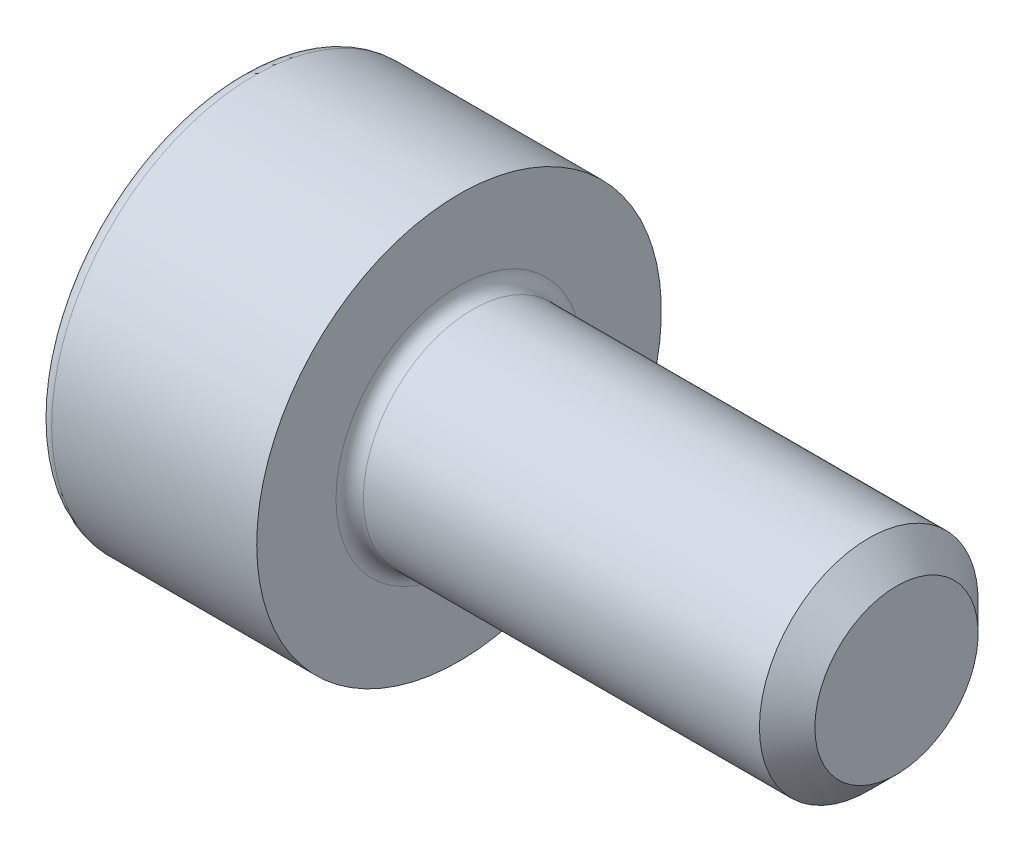
ISO-10303-21;
HEADER;
FILE_DESCRIPTION(('STEP AP214'),'2;1');
FILE_NAME('part.step','',(''),(''),'','','');
FILE_SCHEMA(('AUTOMOTIVE_DESIGN { 1 0 10303 214 1 1 1 1 }'));
ENDSEC;
DATA;
#1=APPLICATION_CONTEXT('core data for automotive mechanical design processes');
#2=APPLICATION_PROTOCOL_DEFINITION('international standard','automotive_design',2000,#1);
#3=PRODUCT_CONTEXT('',#1,'mechanical');
#4=PRODUCT('Part','Part','',(#3));
#5=PRODUCT_RELATED_PRODUCT_CATEGORY('part','',(#4));
#6=PRODUCT_DEFINITION_FORMATION('','',#4);
#7=PRODUCT_DEFINITION_CONTEXT('part definition',#1,'design');
#8=PRODUCT_DEFINITION('design','',#6,#7);
#9=PRODUCT_DEFINITION_SHAPE('','',#8);
#10=(LENGTH_UNIT() NAMED_UNIT(*) SI_UNIT(.MILLI.,.METRE.));
#11=(NAMED_UNIT(*) PLANE_ANGLE_UNIT() SI_UNIT($,.RADIAN.));
#12=(NAMED_UNIT(*) SI_UNIT($,.STERADIAN.) SOLID_ANGLE_UNIT());
#13=UNCERTAINTY_MEASURE_WITH_UNIT(LENGTH_MEASURE(1.E-05),#10,'distance_accuracy_value','');
#14=(GEOMETRIC_REPRESENTATION_CONTEXT(3) GLOBAL_UNCERTAINTY_ASSIGNED_CONTEXT((#13)) GLOBAL_UNIT_ASSIGNED_CONTEXT((#10,
#11,#12)) REPRESENTATION_CONTEXT('',''));
#15=CARTESIAN_POINT('',(0.,0.,0.));
#16=DIRECTION('',(0.,0.,1.));
#17=DIRECTION('',(1.,0.,0.));
#18=AXIS2_PLACEMENT_3D('',#15,#16,#17);
#19=CARTESIAN_POINT('',(4.,0.,0.));
#20=DIRECTION('',(-1.,0.,0.));
#21=DIRECTION('',(0.,0.,1.));
#22=AXIS2_PLACEMENT_3D('',#19,#20,#21);
#23=CONICAL_SURFACE('',#22,0.746499999993503,0.785398163397449);
#24=CARTESIAN_POINT('',(3.7464999999935,0.,0.));
#25=DIRECTION('',(-1.,0.,0.));
#26=DIRECTION('',(0.,0.,1.));
#27=AXIS2_PLACEMENT_3D('',#24,#25,#26);
#28=CIRCLE('',#27,1.);
#29=CARTESIAN_POINT('',(3.7464999999935,0.,1.));
#30=VERTEX_POINT('',#29);
#31=EDGE_CURVE('E11',#30,#30,#28,.T.);
#32=ORIENTED_EDGE('',*,*,#31,.F.);
#33=EDGE_LOOP('',(#32));
#34=FACE_BOUND('',#33,.T.);
#35=CARTESIAN_POINT('',(4.,0.,0.));
#36=DIRECTION('',(-1.,0.,0.));
#37=DIRECTION('',(0.,0.,1.));
#38=AXIS2_PLACEMENT_3D('',#35,#36,#37);
#39=CIRCLE('',#38,0.746499999993503);
#40=CARTESIAN_POINT('',(4.,0.,0.746499999993503));
#41=VERTEX_POINT('',#40);
#42=EDGE_CURVE('E134',#41,#41,#39,.T.);
#43=ORIENTED_EDGE('',*,*,#42,.T.);
#44=EDGE_LOOP('',(#43));
#45=FACE_BOUND('',#44,.T.);
#46=ADVANCED_FACE('F33',(#34,#45),#23,.T.);
#47=CARTESIAN_POINT('',(-2.,0.,0.));
#48=DIRECTION('',(-1.,0.,0.));
#49=DIRECTION('',(0.,0.,1.));
#50=AXIS2_PLACEMENT_3D('',#47,#48,#49);
#51=CYLINDRICAL_SURFACE('',#50,1.);
#52=CARTESIAN_POINT('',(0.125,0.,0.));
#53=DIRECTION('',(-1.,0.,0.));
#54=DIRECTION('',(0.,0.,1.));
#55=AXIS2_PLACEMENT_3D('',#52,#53,#54);
#56=CIRCLE('',#55,1.);
#57=CARTESIAN_POINT('',(0.125,0.,1.));
#58=VERTEX_POINT('',#57);
#59=EDGE_CURVE('E40',#58,#58,#56,.T.);
#60=ORIENTED_EDGE('',*,*,#59,.F.);
#61=EDGE_LOOP('',(#60));
#62=FACE_BOUND('',#61,.T.);
#63=ORIENTED_EDGE('',*,*,#31,.T.);
#64=EDGE_LOOP('',(#63));
#65=FACE_BOUND('',#64,.T.);
#66=ADVANCED_FACE('F158',(#62,#65),#51,.T.);
#67=CARTESIAN_POINT('',(0.125,0.,0.));
#68=DIRECTION('',(-1.,0.,0.));
#69=DIRECTION('',(0.,0.,1.));
#70=AXIS2_PLACEMENT_3D('',#67,#68,#69);
#71=TOROIDAL_SURFACE('',#70,1.125,0.125);
#72=CARTESIAN_POINT('',(0.,0.,0.));
#73=DIRECTION('',(-1.,0.,0.));
#74=DIRECTION('',(0.,0.,1.));
#75=AXIS2_PLACEMENT_3D('',#72,#73,#74);
#76=CIRCLE('',#75,1.125);
#77=CARTESIAN_POINT('',(0.,0.,1.125));
#78=VERTEX_POINT('',#77);
#79=EDGE_CURVE('E151',#78,#78,#76,.T.);
#80=ORIENTED_EDGE('',*,*,#79,.F.);
#81=EDGE_LOOP('',(#80));
#82=FACE_BOUND('',#81,.T.);
#83=ORIENTED_EDGE('',*,*,#59,.T.);
#84=EDGE_LOOP('',(#83));
#85=FACE_BOUND('',#84,.T.);
#86=ADVANCED_FACE('F156',(#82,#85),#71,.F.);
#87=CARTESIAN_POINT('',(0.,1.125,0.));
#88=DIRECTION('',(-1.,0.,0.));
#89=DIRECTION('',(0.,0.,1.));
#90=AXIS2_PLACEMENT_3D('',#87,#88,#89);
#91=PLANE('',#90);
#92=CARTESIAN_POINT('',(0.,0.,0.));
#93=DIRECTION('',(-1.,0.,0.));
#94=DIRECTION('',(0.,0.,1.));
#95=AXIS2_PLACEMENT_3D('',#92,#93,#94);
#96=CIRCLE('',#95,1.85);
#97=CARTESIAN_POINT('',(0.,0.,1.85));
#98=VERTEX_POINT('',#97);
#99=EDGE_CURVE('E148',#98,#98,#96,.T.);
#100=ORIENTED_EDGE('',*,*,#99,.F.);
#101=EDGE_LOOP('',(#100));
#102=FACE_BOUND('',#101,.T.);
#103=ORIENTED_EDGE('',*,*,#79,.T.);
#104=EDGE_LOOP('',(#103));
#105=FACE_BOUND('',#104,.T.);
#106=ADVANCED_FACE('F189',(#102,#105),#91,.F.);
#107=CARTESIAN_POINT('',(-2.,0.,0.));
#108=DIRECTION('',(-1.,0.,0.));
#109=DIRECTION('',(0.,0.,1.));
#110=AXIS2_PLACEMENT_3D('',#107,#108,#109);
#111=CYLINDRICAL_SURFACE('',#110,1.85);
#112=CARTESIAN_POINT('',(-1.875,0.,0.));
#113=DIRECTION('',(-1.,0.,0.));
#114=DIRECTION('',(0.,0.,1.));
#115=AXIS2_PLACEMENT_3D('',#112,#113,#114);
#116=CIRCLE('',#115,1.85);
#117=CARTESIAN_POINT('',(-1.875,0.,1.85));
#118=VERTEX_POINT('',#117);
#119=EDGE_CURVE('E145',#118,#118,#116,.T.);
#120=ORIENTED_EDGE('',*,*,#119,.F.);
#121=EDGE_LOOP('',(#120));
#122=FACE_BOUND('',#121,.T.);
#123=ORIENTED_EDGE('',*,*,#99,.T.);
#124=EDGE_LOOP('',(#123));
#125=FACE_BOUND('',#124,.T.);
#126=ADVANCED_FACE('F185',(#122,#125),#111,.T.);
#127=CARTESIAN_POINT('',(-1.875,0.,0.));
#128=DIRECTION('',(-1.,0.,0.));
#129=DIRECTION('',(0.,0.,1.));
#130=AXIS2_PLACEMENT_3D('',#127,#128,#129);
#131=TOROIDAL_SURFACE('',#130,1.725,0.125);
#132=CARTESIAN_POINT('',(-2.,0.,0.));
#133=DIRECTION('',(-1.,0.,0.));
#134=DIRECTION('',(0.,0.,1.));
#135=AXIS2_PLACEMENT_3D('',#132,#133,#134);
#136=CIRCLE('',#135,1.725);
#137=CARTESIAN_POINT('',(-2.,0.,1.725));
#138=VERTEX_POINT('',#137);
#139=EDGE_CURVE('E142',#138,#138,#136,.T.);
#140=ORIENTED_EDGE('',*,*,#139,.F.);
#141=EDGE_LOOP('',(#140));
#142=FACE_BOUND('',#141,.T.);
#143=ORIENTED_EDGE('',*,*,#119,.T.);
#144=EDGE_LOOP('',(#143));
#145=FACE_BOUND('',#144,.T.);
#146=ADVANCED_FACE('F178',(#142,#145),#131,.T.);
#147=CARTESIAN_POINT('',(-2.,1.725,0.));
#148=DIRECTION('',(1.,0.,0.));
#149=DIRECTION('',(0.,0.,-1.));
#150=AXIS2_PLACEMENT_3D('',#147,#148,#149);
#151=PLANE('',#150);
#152=DIRECTION('',(0.,0.5,-0.866025403784438));
#153=VECTOR('',#152,1.);
#154=CARTESIAN_POINT('',(-2.,0.433012701892219,0.75));
#155=LINE('',#154,#153);
#156=CARTESIAN_POINT('',(-2.,0.433012701892219,0.75));
#157=VERTEX_POINT('',#156);
#158=CARTESIAN_POINT('',(-2.,0.866025403784439,0.));
#159=VERTEX_POINT('',#158);
#160=EDGE_CURVE('E121',#157,#159,#155,.T.);
#161=ORIENTED_EDGE('',*,*,#160,.F.);
#162=DIRECTION('',(0.,1.,0.));
#163=VECTOR('',#162,1.);
#164=CARTESIAN_POINT('',(-2.,-0.43301270189222,0.75));
#165=LINE('',#164,#163);
#166=CARTESIAN_POINT('',(-2.,-0.43301270189222,0.75));
#167=VERTEX_POINT('',#166);
#168=EDGE_CURVE('E47',#167,#157,#165,.T.);
#169=ORIENTED_EDGE('',*,*,#168,.F.);
#170=DIRECTION('',(0.,0.5,0.866025403784439));
#171=VECTOR('',#170,1.);
#172=CARTESIAN_POINT('',(-2.,-0.866025403784439,0.));
#173=LINE('',#172,#171);
#174=CARTESIAN_POINT('',(-2.,-0.866025403784439,0.));
#175=VERTEX_POINT('',#174);
#176=EDGE_CURVE('E130',#175,#167,#173,.T.);
#177=ORIENTED_EDGE('',*,*,#176,.F.);
#178=DIRECTION('',(0.,-0.5,0.866025403784439));
#179=VECTOR('',#178,1.);
#180=CARTESIAN_POINT('',(-2.,-0.433012701892219,-0.75));
#181=LINE('',#180,#179);
#182=CARTESIAN_POINT('',(-2.,-0.433012701892219,-0.75));
#183=VERTEX_POINT('',#182);
#184=EDGE_CURVE('E128',#183,#175,#181,.T.);
#185=ORIENTED_EDGE('',*,*,#184,.F.);
#186=DIRECTION('',(0.,-1.,0.));
#187=VECTOR('',#186,1.);
#188=CARTESIAN_POINT('',(-2.,0.43301270189222,-0.75));
#189=LINE('',#188,#187);
#190=CARTESIAN_POINT('',(-2.,0.43301270189222,-0.75));
#191=VERTEX_POINT('',#190);
#192=EDGE_CURVE('E95',#191,#183,#189,.T.);
#193=ORIENTED_EDGE('',*,*,#192,.F.);
#194=DIRECTION('',(0.,-0.5,-0.866025403784439));
#195=VECTOR('',#194,1.);
#196=CARTESIAN_POINT('',(-2.,0.866025403784439,0.));
#197=LINE('',#196,#195);
#198=EDGE_CURVE('E124',#159,#191,#197,.T.);
#199=ORIENTED_EDGE('',*,*,#198,.F.);
#200=EDGE_LOOP('',(#161,#169,#177,#185,#193,#199));
#201=FACE_BOUND('',#200,.T.);
#202=ORIENTED_EDGE('',*,*,#139,.T.);
#203=EDGE_LOOP('',(#202));
#204=FACE_BOUND('',#203,.T.);
#205=ADVANCED_FACE('F170',(#201,#204),#151,.F.);
#206=CARTESIAN_POINT('',(4.,0.746499999993503,0.));
#207=DIRECTION('',(-1.,0.,0.));
#208=DIRECTION('',(0.,0.,1.));
#209=AXIS2_PLACEMENT_3D('',#206,#207,#208);
#210=PLANE('',#209);
#211=ORIENTED_EDGE('',*,*,#42,.F.);
#212=EDGE_LOOP('',(#211));
#213=FACE_BOUND('',#212,.T.);
#214=ADVANCED_FACE('F167',(#213),#210,.F.);
#215=CARTESIAN_POINT('',(-0.9,-0.43301270189222,0.75));
#216=DIRECTION('',(0.,0.,1.));
#217=DIRECTION('',(1.,0.,0.));
#218=AXIS2_PLACEMENT_3D('',#215,#216,#217);
#219=PLANE('',#218);
#220=ORIENTED_EDGE('',*,*,#168,.T.);
#221=DIRECTION('',(-1.,0.,0.));
#222=VECTOR('',#221,1.);
#223=CARTESIAN_POINT('',(-0.9,0.433012701892219,0.75));
#224=LINE('',#223,#222);
#225=CARTESIAN_POINT('',(-0.9,0.433012701892219,0.75));
#226=VERTEX_POINT('',#225);
#227=EDGE_CURVE('E77',#226,#157,#224,.T.);
#228=ORIENTED_EDGE('',*,*,#227,.F.);
#229=DIRECTION('',(0.,1.,0.));
#230=VECTOR('',#229,1.);
#231=CARTESIAN_POINT('',(-0.9,-0.43301270189222,0.75));
#232=LINE('',#231,#230);
#233=CARTESIAN_POINT('',(-0.9,-0.43301270189222,0.75));
#234=VERTEX_POINT('',#233);
#235=EDGE_CURVE('E132',#234,#226,#232,.T.);
#236=ORIENTED_EDGE('',*,*,#235,.F.);
#237=DIRECTION('',(-1.,0.,0.));
#238=VECTOR('',#237,1.);
#239=CARTESIAN_POINT('',(-0.9,-0.43301270189222,0.75));
#240=LINE('',#239,#238);
#241=EDGE_CURVE('E55',#234,#167,#240,.T.);
#242=ORIENTED_EDGE('',*,*,#241,.T.);
#243=EDGE_LOOP('',(#220,#228,#236,#242));
#244=FACE_BOUND('',#243,.T.);
#245=ADVANCED_FACE('F169',(#244),#219,.F.);
#246=CARTESIAN_POINT('',(-0.9,-0.866025403784439,0.));
#247=DIRECTION('',(0.,-0.866025403784439,0.5));
#248=DIRECTION('',(0.,-0.5,-0.866025403784439));
#249=AXIS2_PLACEMENT_3D('',#246,#247,#248);
#250=PLANE('',#249);
#251=ORIENTED_EDGE('',*,*,#176,.T.);
#252=ORIENTED_EDGE('',*,*,#241,.F.);
#253=DIRECTION('',(0.,0.5,0.866025403784439));
#254=VECTOR('',#253,1.);
#255=CARTESIAN_POINT('',(-0.9,-0.866025403784439,0.));
#256=LINE('',#255,#254);
#257=CARTESIAN_POINT('',(-0.9,-0.866025403784439,0.));
#258=VERTEX_POINT('',#257);
#259=EDGE_CURVE('E107',#258,#234,#256,.T.);
#260=ORIENTED_EDGE('',*,*,#259,.F.);
#261=DIRECTION('',(-1.,0.,0.));
#262=VECTOR('',#261,1.);
#263=CARTESIAN_POINT('',(-0.9,-0.866025403784439,0.));
#264=LINE('',#263,#262);
#265=EDGE_CURVE('E99',#258,#175,#264,.T.);
#266=ORIENTED_EDGE('',*,*,#265,.T.);
#267=EDGE_LOOP('',(#251,#252,#260,#266));
#268=FACE_BOUND('',#267,.T.);
#269=ADVANCED_FACE('F176',(#268),#250,.F.);
#270=CARTESIAN_POINT('',(-0.9,-0.433012701892219,-0.75));
#271=DIRECTION('',(0.,-0.866025403784439,-0.5));
#272=DIRECTION('',(0.,0.5,-0.866025403784439));
#273=AXIS2_PLACEMENT_3D('',#270,#271,#272);
#274=PLANE('',#273);
#275=ORIENTED_EDGE('',*,*,#184,.T.);
#276=ORIENTED_EDGE('',*,*,#265,.F.);
#277=DIRECTION('',(0.,-0.5,0.866025403784439));
#278=VECTOR('',#277,1.);
#279=CARTESIAN_POINT('',(-0.9,-0.433012701892219,-0.75));
#280=LINE('',#279,#278);
#281=CARTESIAN_POINT('',(-0.9,-0.433012701892219,-0.75));
#282=VERTEX_POINT('',#281);
#283=EDGE_CURVE('E103',#282,#258,#280,.T.);
#284=ORIENTED_EDGE('',*,*,#283,.F.);
#285=DIRECTION('',(-1.,0.,0.));
#286=VECTOR('',#285,1.);
#287=CARTESIAN_POINT('',(-0.9,-0.433012701892219,-0.75));
#288=LINE('',#287,#286);
#289=EDGE_CURVE('E88',#282,#183,#288,.T.);
#290=ORIENTED_EDGE('',*,*,#289,.T.);
#291=EDGE_LOOP('',(#275,#276,#284,#290));
#292=FACE_BOUND('',#291,.T.);
#293=ADVANCED_FACE('F104',(#292),#274,.F.);
#294=CARTESIAN_POINT('',(-0.9,0.43301270189222,-0.75));
#295=DIRECTION('',(0.,0.,-1.));
#296=DIRECTION('',(0.,1.,0.));
#297=AXIS2_PLACEMENT_3D('',#294,#295,#296);
#298=PLANE('',#297);
#299=ORIENTED_EDGE('',*,*,#192,.T.);
#300=ORIENTED_EDGE('',*,*,#289,.F.);
#301=DIRECTION('',(0.,-1.,0.));
#302=VECTOR('',#301,1.);
#303=CARTESIAN_POINT('',(-0.9,0.43301270189222,-0.75));
#304=LINE('',#303,#302);
#305=CARTESIAN_POINT('',(-0.9,0.43301270189222,-0.75));
#306=VERTEX_POINT('',#305);
#307=EDGE_CURVE('E92',#306,#282,#304,.T.);
#308=ORIENTED_EDGE('',*,*,#307,.F.);
#309=DIRECTION('',(-1.,0.,0.));
#310=VECTOR('',#309,1.);
#311=CARTESIAN_POINT('',(-0.9,0.43301270189222,-0.75));
#312=LINE('',#311,#310);
#313=EDGE_CURVE('E100',#306,#191,#312,.T.);
#314=ORIENTED_EDGE('',*,*,#313,.T.);
#315=EDGE_LOOP('',(#299,#300,#308,#314));
#316=FACE_BOUND('',#315,.T.);
#317=ADVANCED_FACE('F90',(#316),#298,.F.);
#318=CARTESIAN_POINT('',(-0.9,0.866025403784439,0.));
#319=DIRECTION('',(0.,0.866025403784439,-0.5));
#320=DIRECTION('',(0.,0.5,0.866025403784439));
#321=AXIS2_PLACEMENT_3D('',#318,#319,#320);
#322=PLANE('',#321);
#323=ORIENTED_EDGE('',*,*,#198,.T.);
#324=ORIENTED_EDGE('',*,*,#313,.F.);
#325=DIRECTION('',(0.,-0.5,-0.866025403784439));
#326=VECTOR('',#325,1.);
#327=CARTESIAN_POINT('',(-0.9,0.866025403784439,0.));
#328=LINE('',#327,#326);
#329=CARTESIAN_POINT('',(-0.9,0.866025403784439,0.));
#330=VERTEX_POINT('',#329);
#331=EDGE_CURVE('E113',#330,#306,#328,.T.);
#332=ORIENTED_EDGE('',*,*,#331,.F.);
#333=DIRECTION('',(-1.,0.,0.));
#334=VECTOR('',#333,1.);
#335=CARTESIAN_POINT('',(-0.9,0.866025403784439,0.));
#336=LINE('',#335,#334);
#337=EDGE_CURVE('E137',#330,#159,#336,.T.);
#338=ORIENTED_EDGE('',*,*,#337,.T.);
#339=EDGE_LOOP('',(#323,#324,#332,#338));
#340=FACE_BOUND('',#339,.T.);
#341=ADVANCED_FACE('F251',(#340),#322,.F.);
#342=CARTESIAN_POINT('',(-0.9,0.433012701892219,0.75));
#343=DIRECTION('',(0.,0.866025403784439,0.5));
#344=DIRECTION('',(0.,-0.5,0.866025403784438));
#345=AXIS2_PLACEMENT_3D('',#342,#343,#344);
#346=PLANE('',#345);
#347=ORIENTED_EDGE('',*,*,#160,.T.);
#348=ORIENTED_EDGE('',*,*,#337,.F.);
#349=DIRECTION('',(0.,0.5,-0.866025403784438));
#350=VECTOR('',#349,1.);
#351=CARTESIAN_POINT('',(-0.9,0.433012701892219,0.75));
#352=LINE('',#351,#350);
#353=EDGE_CURVE('E115',#226,#330,#352,.T.);
#354=ORIENTED_EDGE('',*,*,#353,.F.);
#355=ORIENTED_EDGE('',*,*,#227,.T.);
#356=EDGE_LOOP('',(#347,#348,#354,#355));
#357=FACE_BOUND('',#356,.T.);
#358=ADVANCED_FACE('F260',(#357),#346,.F.);
#359=CARTESIAN_POINT('',(-0.9,0.,0.));
#360=DIRECTION('',(-1.,0.,0.));
#361=DIRECTION('',(0.,0.,1.));
#362=AXIS2_PLACEMENT_3D('',#359,#360,#361);
#363=PLANE('',#362);
#364=ORIENTED_EDGE('',*,*,#235,.T.);
#365=ORIENTED_EDGE('',*,*,#353,.T.);
#366=ORIENTED_EDGE('',*,*,#331,.T.);
#367=ORIENTED_EDGE('',*,*,#307,.T.);
#368=ORIENTED_EDGE('',*,*,#283,.T.);
#369=ORIENTED_EDGE('',*,*,#259,.T.);
#370=EDGE_LOOP('',(#364,#365,#366,#367,#368,#369));
#371=FACE_BOUND('',#370,.T.);
#372=ADVANCED_FACE('F110',(#371),#363,.T.);
#373=CLOSED_SHELL('',(#46,#66,#86,#106,#126,#146,#205,#214,#245,#269,#293,#317,#341,#358,#372));
#374=MANIFOLD_SOLID_BREP('B2',#373);
#375=ADVANCED_BREP_SHAPE_REPRESENTATION('',(#18,#374),#14);
#376=SHAPE_DEFINITION_REPRESENTATION(#9,#375);
ENDSEC;
END-ISO-10303-21;
